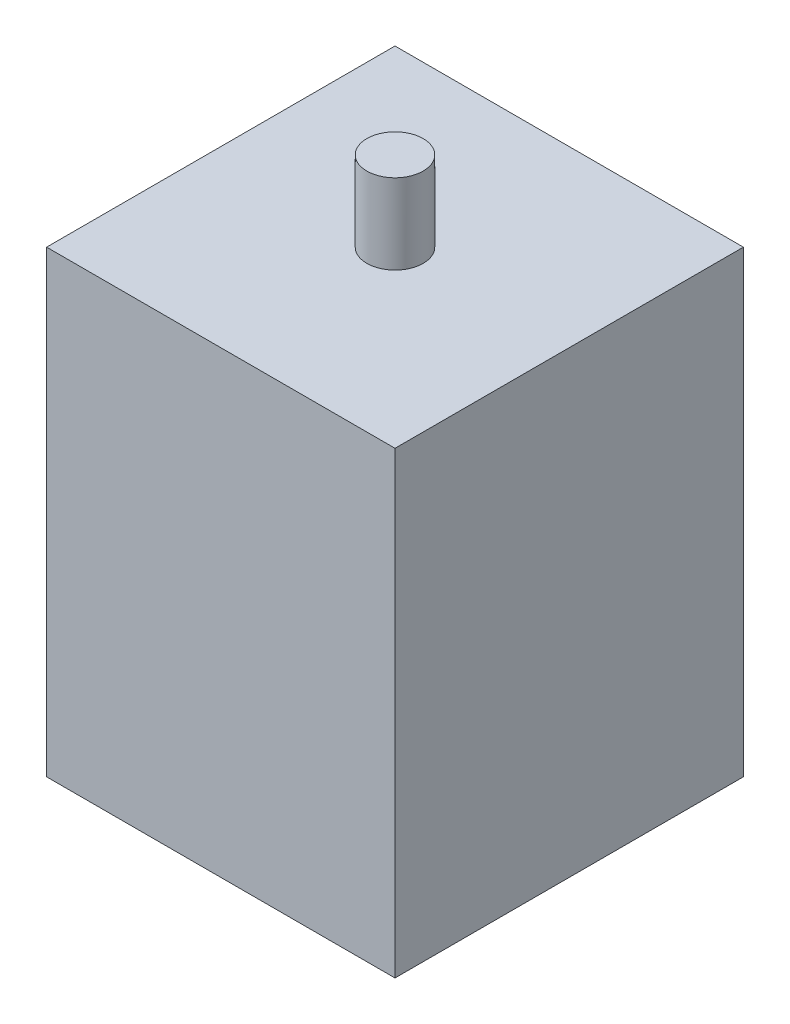
ISO-10303-21;
HEADER;
FILE_DESCRIPTION(('STEP AP214'),'2;1');
FILE_NAME('part.step','',(''),(''),'','','');
FILE_SCHEMA(('AUTOMOTIVE_DESIGN { 1 0 10303 214 1 1 1 1 }'));
ENDSEC;
DATA;
#1=APPLICATION_CONTEXT('core data for automotive mechanical design processes');
#2=APPLICATION_PROTOCOL_DEFINITION('international standard','automotive_design',2000,#1);
#3=PRODUCT_CONTEXT('',#1,'mechanical');
#4=PRODUCT('Part','Part','',(#3));
#5=PRODUCT_RELATED_PRODUCT_CATEGORY('part','',(#4));
#6=PRODUCT_DEFINITION_FORMATION('','',#4);
#7=PRODUCT_DEFINITION_CONTEXT('part definition',#1,'design');
#8=PRODUCT_DEFINITION('design','',#6,#7);
#9=PRODUCT_DEFINITION_SHAPE('','',#8);
#10=(LENGTH_UNIT() NAMED_UNIT(*) SI_UNIT(.MILLI.,.METRE.));
#11=(NAMED_UNIT(*) PLANE_ANGLE_UNIT() SI_UNIT($,.RADIAN.));
#12=(NAMED_UNIT(*) SI_UNIT($,.STERADIAN.) SOLID_ANGLE_UNIT());
#13=UNCERTAINTY_MEASURE_WITH_UNIT(LENGTH_MEASURE(1.E-05),#10,'distance_accuracy_value','');
#14=(GEOMETRIC_REPRESENTATION_CONTEXT(3) GLOBAL_UNCERTAINTY_ASSIGNED_CONTEXT((#13)) GLOBAL_UNIT_ASSIGNED_CONTEXT((#10,
#11,#12)) REPRESENTATION_CONTEXT('',''));
#15=CARTESIAN_POINT('',(0.,0.,0.));
#16=DIRECTION('',(0.,0.,1.));
#17=DIRECTION('',(1.,0.,0.));
#18=AXIS2_PLACEMENT_3D('',#15,#16,#17);
#19=CARTESIAN_POINT('',(0.,122.2,0.));
#20=DIRECTION('',(1.,0.,0.));
#21=DIRECTION('',(0.,0.,-1.));
#22=AXIS2_PLACEMENT_3D('',#19,#20,#21);
#23=PLANE('',#22);
#24=DIRECTION('',(0.,0.,1.));
#25=VECTOR('',#24,1.);
#26=CARTESIAN_POINT('',(0.,0.,0.));
#27=LINE('',#26,#25);
#28=CARTESIAN_POINT('',(0.,0.,-92.8));
#29=VERTEX_POINT('',#28);
#30=CARTESIAN_POINT('',(0.,0.,0.));
#31=VERTEX_POINT('',#30);
#32=EDGE_CURVE('E112',#29,#31,#27,.T.);
#33=ORIENTED_EDGE('',*,*,#32,.T.);
#34=DIRECTION('',(0.,-1.,0.));
#35=VECTOR('',#34,1.);
#36=CARTESIAN_POINT('',(0.,122.2,0.));
#37=LINE('',#36,#35);
#38=CARTESIAN_POINT('',(0.,122.2,0.));
#39=VERTEX_POINT('',#38);
#40=EDGE_CURVE('E54',#39,#31,#37,.T.);
#41=ORIENTED_EDGE('',*,*,#40,.F.);
#42=DIRECTION('',(0.,0.,1.));
#43=VECTOR('',#42,1.);
#44=CARTESIAN_POINT('',(0.,122.2,0.));
#45=LINE('',#44,#43);
#46=CARTESIAN_POINT('',(0.,122.2,-92.8));
#47=VERTEX_POINT('',#46);
#48=EDGE_CURVE('E98',#47,#39,#45,.T.);
#49=ORIENTED_EDGE('',*,*,#48,.F.);
#50=DIRECTION('',(0.,-1.,0.));
#51=VECTOR('',#50,1.);
#52=CARTESIAN_POINT('',(0.,122.2,-92.8));
#53=LINE('',#52,#51);
#54=EDGE_CURVE('E108',#47,#29,#53,.T.);
#55=ORIENTED_EDGE('',*,*,#54,.T.);
#56=EDGE_LOOP('',(#33,#41,#49,#55));
#57=FACE_BOUND('',#56,.T.);
#58=ADVANCED_FACE('F46',(#57),#23,.F.);
#59=CARTESIAN_POINT('',(0.,122.2,0.));
#60=DIRECTION('',(0.,0.,-1.));
#61=DIRECTION('',(-1.,0.,0.));
#62=AXIS2_PLACEMENT_3D('',#59,#60,#61);
#63=PLANE('',#62);
#64=DIRECTION('',(1.,0.,0.));
#65=VECTOR('',#64,1.);
#66=CARTESIAN_POINT('',(0.,0.,0.));
#67=LINE('',#66,#65);
#68=CARTESIAN_POINT('',(92.8,0.,0.));
#69=VERTEX_POINT('',#68);
#70=EDGE_CURVE('E103',#31,#69,#67,.T.);
#71=ORIENTED_EDGE('',*,*,#70,.T.);
#72=DIRECTION('',(0.,-1.,0.));
#73=VECTOR('',#72,1.);
#74=CARTESIAN_POINT('',(92.8,122.2,0.));
#75=LINE('',#74,#73);
#76=CARTESIAN_POINT('',(92.8,122.2,0.));
#77=VERTEX_POINT('',#76);
#78=EDGE_CURVE('E101',#77,#69,#75,.T.);
#79=ORIENTED_EDGE('',*,*,#78,.F.);
#80=DIRECTION('',(1.,0.,0.));
#81=VECTOR('',#80,1.);
#82=CARTESIAN_POINT('',(0.,122.2,0.));
#83=LINE('',#82,#81);
#84=EDGE_CURVE('E93',#39,#77,#83,.T.);
#85=ORIENTED_EDGE('',*,*,#84,.F.);
#86=ORIENTED_EDGE('',*,*,#40,.T.);
#87=EDGE_LOOP('',(#71,#79,#85,#86));
#88=FACE_BOUND('',#87,.T.);
#89=ADVANCED_FACE('F102',(#88),#63,.F.);
#90=CARTESIAN_POINT('',(92.8,122.2,0.));
#91=DIRECTION('',(-1.,0.,0.));
#92=DIRECTION('',(0.,0.,1.));
#93=AXIS2_PLACEMENT_3D('',#90,#91,#92);
#94=PLANE('',#93);
#95=DIRECTION('',(0.,0.,-1.));
#96=VECTOR('',#95,1.);
#97=CARTESIAN_POINT('',(92.8,0.,0.));
#98=LINE('',#97,#96);
#99=CARTESIAN_POINT('',(92.8,0.,-92.8));
#100=VERTEX_POINT('',#99);
#101=EDGE_CURVE('E79',#69,#100,#98,.T.);
#102=ORIENTED_EDGE('',*,*,#101,.T.);
#103=DIRECTION('',(0.,-1.,0.));
#104=VECTOR('',#103,1.);
#105=CARTESIAN_POINT('',(92.8,122.2,-92.8));
#106=LINE('',#105,#104);
#107=CARTESIAN_POINT('',(92.8,122.2,-92.8));
#108=VERTEX_POINT('',#107);
#109=EDGE_CURVE('E104',#108,#100,#106,.T.);
#110=ORIENTED_EDGE('',*,*,#109,.F.);
#111=DIRECTION('',(0.,0.,-1.));
#112=VECTOR('',#111,1.);
#113=CARTESIAN_POINT('',(92.8,122.2,0.));
#114=LINE('',#113,#112);
#115=EDGE_CURVE('E96',#77,#108,#114,.T.);
#116=ORIENTED_EDGE('',*,*,#115,.F.);
#117=ORIENTED_EDGE('',*,*,#78,.T.);
#118=EDGE_LOOP('',(#102,#110,#116,#117));
#119=FACE_BOUND('',#118,.T.);
#120=ADVANCED_FACE('F106',(#119),#94,.F.);
#121=CARTESIAN_POINT('',(0.,122.2,-92.8));
#122=DIRECTION('',(0.,0.,1.));
#123=DIRECTION('',(1.,0.,0.));
#124=AXIS2_PLACEMENT_3D('',#121,#122,#123);
#125=PLANE('',#124);
#126=DIRECTION('',(-1.,0.,0.));
#127=VECTOR('',#126,1.);
#128=CARTESIAN_POINT('',(0.,0.,-92.8));
#129=LINE('',#128,#127);
#130=EDGE_CURVE('E85',#100,#29,#129,.T.);
#131=ORIENTED_EDGE('',*,*,#130,.T.);
#132=ORIENTED_EDGE('',*,*,#54,.F.);
#133=DIRECTION('',(-1.,0.,0.));
#134=VECTOR('',#133,1.);
#135=CARTESIAN_POINT('',(0.,122.2,-92.8));
#136=LINE('',#135,#134);
#137=EDGE_CURVE('E62',#108,#47,#136,.T.);
#138=ORIENTED_EDGE('',*,*,#137,.F.);
#139=ORIENTED_EDGE('',*,*,#109,.T.);
#140=EDGE_LOOP('',(#131,#132,#138,#139));
#141=FACE_BOUND('',#140,.T.);
#142=ADVANCED_FACE('F134',(#141),#125,.F.);
#143=CARTESIAN_POINT('',(0.,122.2,0.));
#144=DIRECTION('',(0.,-1.,0.));
#145=DIRECTION('',(0.,0.,-1.));
#146=AXIS2_PLACEMENT_3D('',#143,#144,#145);
#147=PLANE('',#146);
#148=CARTESIAN_POINT('',(46.4,122.2,-46.4));
#149=DIRECTION('',(0.,-1.,0.));
#150=DIRECTION('',(0.,0.,-1.));
#151=AXIS2_PLACEMENT_3D('',#148,#149,#150);
#152=CIRCLE('',#151,7.5);
#153=CARTESIAN_POINT('',(46.4,122.2,-53.9));
#154=VERTEX_POINT('',#153);
#155=EDGE_CURVE('E11',#154,#154,#152,.F.);
#156=ORIENTED_EDGE('',*,*,#155,.F.);
#157=EDGE_LOOP('',(#156));
#158=FACE_BOUND('',#157,.T.);
#159=ORIENTED_EDGE('',*,*,#48,.T.);
#160=ORIENTED_EDGE('',*,*,#84,.T.);
#161=ORIENTED_EDGE('',*,*,#115,.T.);
#162=ORIENTED_EDGE('',*,*,#137,.T.);
#163=EDGE_LOOP('',(#159,#160,#161,#162));
#164=FACE_BOUND('',#163,.T.);
#165=ADVANCED_FACE('F94',(#158,#164),#147,.F.);
#166=CARTESIAN_POINT('',(0.,0.,0.));
#167=DIRECTION('',(0.,-1.,0.));
#168=DIRECTION('',(0.,0.,-1.));
#169=AXIS2_PLACEMENT_3D('',#166,#167,#168);
#170=PLANE('',#169);
#171=ORIENTED_EDGE('',*,*,#32,.F.);
#172=ORIENTED_EDGE('',*,*,#130,.F.);
#173=ORIENTED_EDGE('',*,*,#101,.F.);
#174=ORIENTED_EDGE('',*,*,#70,.F.);
#175=EDGE_LOOP('',(#171,#172,#173,#174));
#176=FACE_BOUND('',#175,.T.);
#177=ADVANCED_FACE('F123',(#176),#170,.T.);
#178=CARTESIAN_POINT('',(46.4,143.5,-46.4));
#179=DIRECTION('',(0.,-1.,0.));
#180=DIRECTION('',(0.,0.,-1.));
#181=AXIS2_PLACEMENT_3D('',#178,#179,#180);
#182=CYLINDRICAL_SURFACE('',#181,7.5);
#183=CARTESIAN_POINT('',(46.4,143.5,-46.4));
#184=DIRECTION('',(0.,1.,0.));
#185=DIRECTION('',(0.,0.,1.));
#186=AXIS2_PLACEMENT_3D('',#183,#184,#185);
#187=CIRCLE('',#186,7.5);
#188=CARTESIAN_POINT('',(46.4,143.5,-38.9));
#189=VERTEX_POINT('',#188);
#190=EDGE_CURVE('E115',#189,#189,#187,.T.);
#191=ORIENTED_EDGE('',*,*,#190,.F.);
#192=EDGE_LOOP('',(#191));
#193=FACE_BOUND('',#192,.T.);
#194=ORIENTED_EDGE('',*,*,#155,.T.);
#195=EDGE_LOOP('',(#194));
#196=FACE_BOUND('',#195,.T.);
#197=ADVANCED_FACE('F125',(#193,#196),#182,.T.);
#198=CARTESIAN_POINT('',(46.4,143.5,-46.4));
#199=DIRECTION('',(0.,1.,0.));
#200=DIRECTION('',(0.,0.,1.));
#201=AXIS2_PLACEMENT_3D('',#198,#199,#200);
#202=PLANE('',#201);
#203=ORIENTED_EDGE('',*,*,#190,.T.);
#204=EDGE_LOOP('',(#203));
#205=FACE_BOUND('',#204,.T.);
#206=ADVANCED_FACE('F131',(#205),#202,.T.);
#207=CLOSED_SHELL('',(#58,#89,#120,#142,#165,#177,#197,#206));
#208=MANIFOLD_SOLID_BREP('B2',#207);
#209=ADVANCED_BREP_SHAPE_REPRESENTATION('',(#18,#208),#14);
#210=SHAPE_DEFINITION_REPRESENTATION(#9,#209);
ENDSEC;
END-ISO-10303-21;
